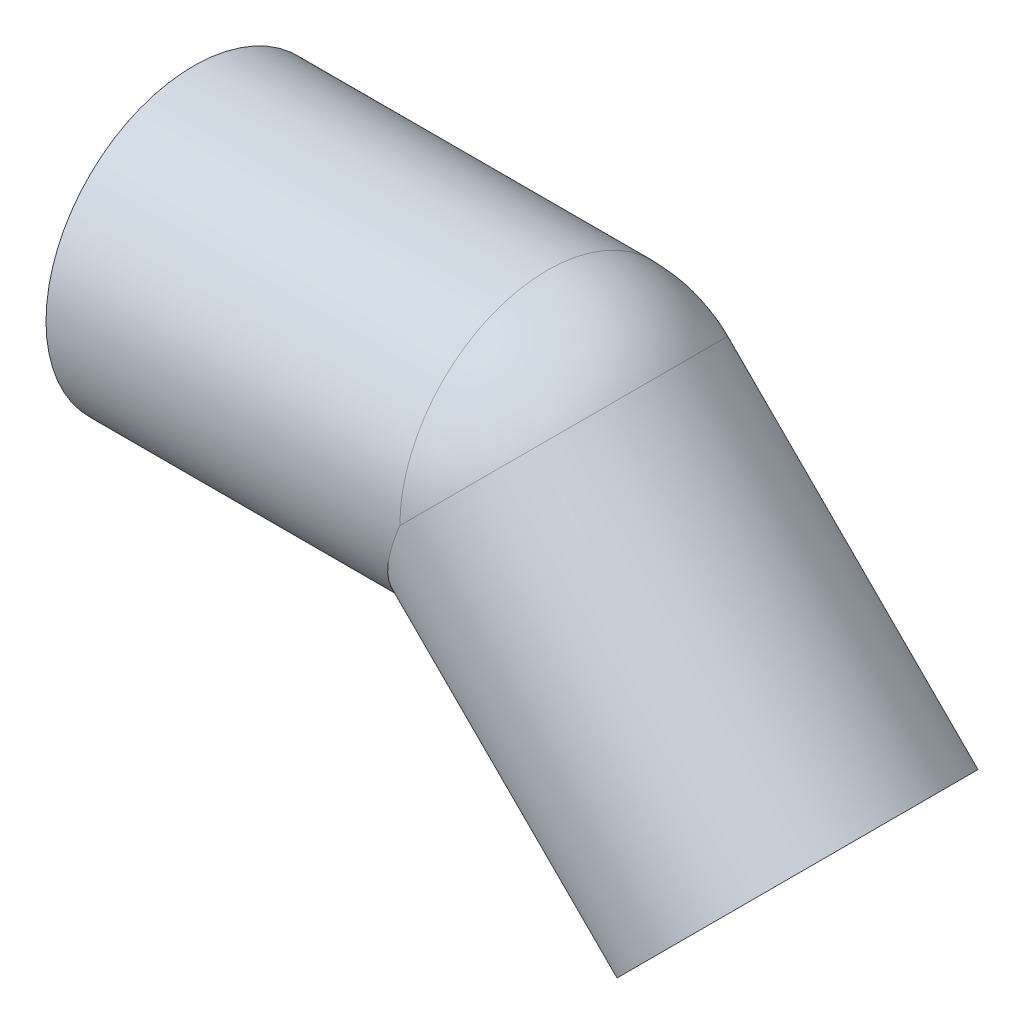
ISO-10303-21;
HEADER;
FILE_DESCRIPTION(('STEP AP214'),'2;1');
FILE_NAME('part.step','',(''),(''),'','','');
FILE_SCHEMA(('AUTOMOTIVE_DESIGN { 1 0 10303 214 1 1 1 1 }'));
ENDSEC;
DATA;
#1=APPLICATION_CONTEXT('core data for automotive mechanical design processes');
#2=APPLICATION_PROTOCOL_DEFINITION('international standard','automotive_design',2000,#1);
#3=PRODUCT_CONTEXT('',#1,'mechanical');
#4=PRODUCT('Part','Part','',(#3));
#5=PRODUCT_RELATED_PRODUCT_CATEGORY('part','',(#4));
#6=PRODUCT_DEFINITION_FORMATION('','',#4);
#7=PRODUCT_DEFINITION_CONTEXT('part definition',#1,'design');
#8=PRODUCT_DEFINITION('design','',#6,#7);
#9=PRODUCT_DEFINITION_SHAPE('','',#8);
#10=(LENGTH_UNIT() NAMED_UNIT(*) SI_UNIT(.MILLI.,.METRE.));
#11=(NAMED_UNIT(*) PLANE_ANGLE_UNIT() SI_UNIT($,.RADIAN.));
#12=(NAMED_UNIT(*) SI_UNIT($,.STERADIAN.) SOLID_ANGLE_UNIT());
#13=UNCERTAINTY_MEASURE_WITH_UNIT(LENGTH_MEASURE(1.E-05),#10,'distance_accuracy_value','');
#14=(GEOMETRIC_REPRESENTATION_CONTEXT(3) GLOBAL_UNCERTAINTY_ASSIGNED_CONTEXT((#13)) GLOBAL_UNIT_ASSIGNED_CONTEXT((#10,
#11,#12)) REPRESENTATION_CONTEXT('',''));
#15=CARTESIAN_POINT('',(0.,0.,0.));
#16=DIRECTION('',(0.,0.,1.));
#17=DIRECTION('',(1.,0.,0.));
#18=AXIS2_PLACEMENT_3D('',#15,#16,#17);
#19=CARTESIAN_POINT('',(153.639610306789,-63.6396103067892,0.));
#20=DIRECTION('',(-0.707106781186549,0.707106781186546,0.));
#21=DIRECTION('',(-0.707106781186546,-0.707106781186549,0.));
#22=AXIS2_PLACEMENT_3D('',#19,#20,#21);
#23=CYLINDRICAL_SURFACE('',#22,30.7);
#24=CARTESIAN_POINT('',(89.9999999999998,0.,0.));
#25=DIRECTION('',(-0.923879532511287,0.382683432365089,0.));
#26=DIRECTION('',(-0.382683432365089,-0.923879532511287,0.));
#27=AXIS2_PLACEMENT_3D('',#24,#25,#26);
#28=ELLIPSE('',#27,33.2294405489765,30.7);
#29=CARTESIAN_POINT('',(89.9999999999999,0.,30.7));
#30=VERTEX_POINT('',#29);
#31=CARTESIAN_POINT('',(89.9999999999999,0.,-30.7));
#32=VERTEX_POINT('',#31);
#33=EDGE_CURVE('E53',#30,#32,#28,.F.);
#34=ORIENTED_EDGE('',*,*,#33,.F.);
#35=CARTESIAN_POINT('',(90.,0.,0.));
#36=DIRECTION('',(0.707106781191242,-0.707106781181853,0.));
#37=DIRECTION('',(0.,0.,-1.));
#38=AXIS2_PLACEMENT_3D('',#35,#36,#37);
#39=CIRCLE('',#38,30.7);
#40=EDGE_CURVE('E43',#32,#30,#39,.T.);
#41=ORIENTED_EDGE('',*,*,#40,.F.);
#42=EDGE_LOOP('',(#34,#41));
#43=FACE_BOUND('',#42,.T.);
#44=CARTESIAN_POINT('',(153.639610306789,-63.6396103067893,0.));
#45=DIRECTION('',(-0.707106781186549,0.707106781186546,0.));
#46=DIRECTION('',(-0.707106781186546,-0.707106781186549,0.));
#47=AXIS2_PLACEMENT_3D('',#44,#45,#46);
#48=CIRCLE('',#47,30.7);
#49=CARTESIAN_POINT('',(131.931432124362,-85.3477884892163,0.));
#50=VERTEX_POINT('',#49);
#51=EDGE_CURVE('E18',#50,#50,#48,.T.);
#52=ORIENTED_EDGE('',*,*,#51,.F.);
#53=EDGE_LOOP('',(#52));
#54=FACE_BOUND('',#53,.T.);
#55=ADVANCED_FACE('F15',(#43,#54),#23,.F.);
#56=CARTESIAN_POINT('',(90.,0.,0.));
#57=DIRECTION('',(0.,0.,1.));
#58=DIRECTION('',(-1.,0.,0.));
#59=AXIS2_PLACEMENT_3D('',#56,#57,#58);
#60=SPHERICAL_SURFACE('',#59,30.7);
#61=CARTESIAN_POINT('',(90.,0.,0.));
#62=DIRECTION('',(-1.,0.,0.));
#63=DIRECTION('',(0.,1.,0.));
#64=AXIS2_PLACEMENT_3D('',#61,#62,#63);
#65=CIRCLE('',#64,30.7);
#66=EDGE_CURVE('E48',#32,#30,#65,.F.);
#67=ORIENTED_EDGE('',*,*,#66,.F.);
#68=ORIENTED_EDGE('',*,*,#40,.T.);
#69=EDGE_LOOP('',(#67,#68));
#70=FACE_BOUND('',#69,.T.);
#71=ADVANCED_FACE('F47',(#70),#60,.F.);
#72=CARTESIAN_POINT('',(180.156114601286,-37.1231060122926,37.9500021082964));
#73=DIRECTION('',(0.707106781186548,-0.707106781186547,0.));
#74=DIRECTION('',(-0.707106781186547,-0.707106781186548,0.));
#75=AXIS2_PLACEMENT_3D('',#72,#73,#74);
#76=PLANE('',#75);
#77=ORIENTED_EDGE('',*,*,#51,.T.);
#78=EDGE_LOOP('',(#77));
#79=FACE_BOUND('',#78,.T.);
#80=CARTESIAN_POINT('',(153.639610306789,-63.6396103067893,0.));
#81=DIRECTION('',(-0.707106781186548,0.707106781186547,0.));
#82=DIRECTION('',(-0.707106781186547,-0.707106781186548,0.));
#83=AXIS2_PLACEMENT_3D('',#80,#81,#82);
#84=CIRCLE('',#83,37.5);
#85=CARTESIAN_POINT('',(127.123106012294,-90.1561146012848,0.));
#86=VERTEX_POINT('',#85);
#87=EDGE_CURVE('E59',#86,#86,#84,.T.);
#88=ORIENTED_EDGE('',*,*,#87,.F.);
#89=EDGE_LOOP('',(#88));
#90=FACE_BOUND('',#89,.T.);
#91=ADVANCED_FACE('F77',(#79,#90),#76,.T.);
#92=CARTESIAN_POINT('',(90.,0.,0.));
#93=DIRECTION('',(-1.,0.,0.));
#94=DIRECTION('',(0.,0.,1.));
#95=AXIS2_PLACEMENT_3D('',#92,#93,#94);
#96=CYLINDRICAL_SURFACE('',#95,30.7);
#97=CARTESIAN_POINT('',(0.,0.,0.));
#98=DIRECTION('',(-1.,0.,0.));
#99=DIRECTION('',(0.,0.,1.));
#100=AXIS2_PLACEMENT_3D('',#97,#98,#99);
#101=CIRCLE('',#100,30.7);
#102=CARTESIAN_POINT('',(0.,0.,30.7));
#103=VERTEX_POINT('',#102);
#104=EDGE_CURVE('E62',#103,#103,#101,.F.);
#105=ORIENTED_EDGE('',*,*,#104,.F.);
#106=EDGE_LOOP('',(#105));
#107=FACE_BOUND('',#106,.T.);
#108=ORIENTED_EDGE('',*,*,#33,.T.);
#109=ORIENTED_EDGE('',*,*,#66,.T.);
#110=EDGE_LOOP('',(#108,#109));
#111=FACE_BOUND('',#110,.T.);
#112=ADVANCED_FACE('F52',(#107,#111),#96,.F.);
#113=CARTESIAN_POINT('',(90.,0.,0.));
#114=DIRECTION('',(0.,0.,1.));
#115=DIRECTION('',(1.,0.,0.));
#116=AXIS2_PLACEMENT_3D('',#113,#114,#115);
#117=SPHERICAL_SURFACE('',#116,37.5);
#118=CARTESIAN_POINT('',(90.,0.,0.));
#119=DIRECTION('',(-1.,0.,0.));
#120=DIRECTION('',(0.,1.,0.));
#121=AXIS2_PLACEMENT_3D('',#118,#119,#120);
#122=CIRCLE('',#121,37.5);
#123=CARTESIAN_POINT('',(90.,0.,37.5));
#124=VERTEX_POINT('',#123);
#125=CARTESIAN_POINT('',(90.,0.,-37.5));
#126=VERTEX_POINT('',#125);
#127=EDGE_CURVE('E65',#124,#126,#122,.T.);
#128=ORIENTED_EDGE('',*,*,#127,.F.);
#129=CARTESIAN_POINT('',(90.,0.,0.));
#130=DIRECTION('',(-0.707106781173962,0.707106781199133,0.));
#131=DIRECTION('',(0.,0.,1.));
#132=AXIS2_PLACEMENT_3D('',#129,#130,#131);
#133=CIRCLE('',#132,37.5);
#134=CARTESIAN_POINT('',(116.516504294731,26.5165042942596,0.));
#135=VERTEX_POINT('',#134);
#136=EDGE_CURVE('E54',#124,#135,#133,.T.);
#137=ORIENTED_EDGE('',*,*,#136,.T.);
#138=CARTESIAN_POINT('',(90.,0.,0.));
#139=DIRECTION('',(-0.707106781186548,0.707106781186548,0.));
#140=DIRECTION('',(0.707106781186548,0.707106781186547,0.));
#141=AXIS2_PLACEMENT_3D('',#138,#139,#140);
#142=CIRCLE('',#141,37.5);
#143=EDGE_CURVE('E33',#126,#135,#142,.F.);
#144=ORIENTED_EDGE('',*,*,#143,.F.);
#145=EDGE_LOOP('',(#128,#137,#144));
#146=FACE_BOUND('',#145,.T.);
#147=ADVANCED_FACE('F83',(#146),#117,.T.);
#148=CARTESIAN_POINT('',(90.,0.,0.));
#149=DIRECTION('',(-0.707106781186548,0.707106781186547,0.));
#150=DIRECTION('',(-0.707106781186547,-0.707106781186548,0.));
#151=AXIS2_PLACEMENT_3D('',#148,#149,#150);
#152=CYLINDRICAL_SURFACE('',#151,37.5);
#153=ORIENTED_EDGE('',*,*,#87,.T.);
#154=EDGE_LOOP('',(#153));
#155=FACE_BOUND('',#154,.T.);
#156=CARTESIAN_POINT('',(90.,0.,0.));
#157=DIRECTION('',(-0.923879532511287,0.38268343236509,0.));
#158=DIRECTION('',(0.38268343236509,0.923879532511287,0.));
#159=AXIS2_PLACEMENT_3D('',#156,#157,#158);
#160=ELLIPSE('',#159,40.5897075109647,37.5);
#161=EDGE_CURVE('E24',#126,#124,#160,.T.);
#162=ORIENTED_EDGE('',*,*,#161,.F.);
#163=ORIENTED_EDGE('',*,*,#143,.T.);
#164=ORIENTED_EDGE('',*,*,#136,.F.);
#165=EDGE_LOOP('',(#162,#163,#164));
#166=FACE_BOUND('',#165,.T.);
#167=ADVANCED_FACE('F87',(#155,#166),#152,.T.);
#168=CARTESIAN_POINT('',(0.,-37.5,37.9500021082962));
#169=DIRECTION('',(-1.,0.,0.));
#170=DIRECTION('',(0.,1.,0.));
#171=AXIS2_PLACEMENT_3D('',#168,#169,#170);
#172=PLANE('',#171);
#173=ORIENTED_EDGE('',*,*,#104,.T.);
#174=EDGE_LOOP('',(#173));
#175=FACE_BOUND('',#174,.T.);
#176=CARTESIAN_POINT('',(0.,0.,0.));
#177=DIRECTION('',(-1.,0.,0.));
#178=DIRECTION('',(0.,0.,1.));
#179=AXIS2_PLACEMENT_3D('',#176,#177,#178);
#180=CIRCLE('',#179,37.5);
#181=CARTESIAN_POINT('',(0.,0.,37.5));
#182=VERTEX_POINT('',#181);
#183=EDGE_CURVE('E9',#182,#182,#180,.F.);
#184=ORIENTED_EDGE('',*,*,#183,.F.);
#185=EDGE_LOOP('',(#184));
#186=FACE_BOUND('',#185,.T.);
#187=ADVANCED_FACE('F101',(#175,#186),#172,.T.);
#188=CARTESIAN_POINT('',(0.,0.,0.));
#189=DIRECTION('',(-1.,0.,0.));
#190=DIRECTION('',(0.,0.,1.));
#191=AXIS2_PLACEMENT_3D('',#188,#189,#190);
#192=CYLINDRICAL_SURFACE('',#191,37.5);
#193=ORIENTED_EDGE('',*,*,#161,.T.);
#194=ORIENTED_EDGE('',*,*,#127,.T.);
#195=EDGE_LOOP('',(#193,#194));
#196=FACE_BOUND('',#195,.T.);
#197=ORIENTED_EDGE('',*,*,#183,.T.);
#198=EDGE_LOOP('',(#197));
#199=FACE_BOUND('',#198,.T.);
#200=ADVANCED_FACE('F98',(#196,#199),#192,.T.);
#201=CLOSED_SHELL('',(#55,#71,#91,#112,#147,#167,#187,#200));
#202=MANIFOLD_SOLID_BREP('B1',#201);
#203=ADVANCED_BREP_SHAPE_REPRESENTATION('',(#18,#202),#14);
#204=SHAPE_DEFINITION_REPRESENTATION(#9,#203);
ENDSEC;
END-ISO-10303-21;
